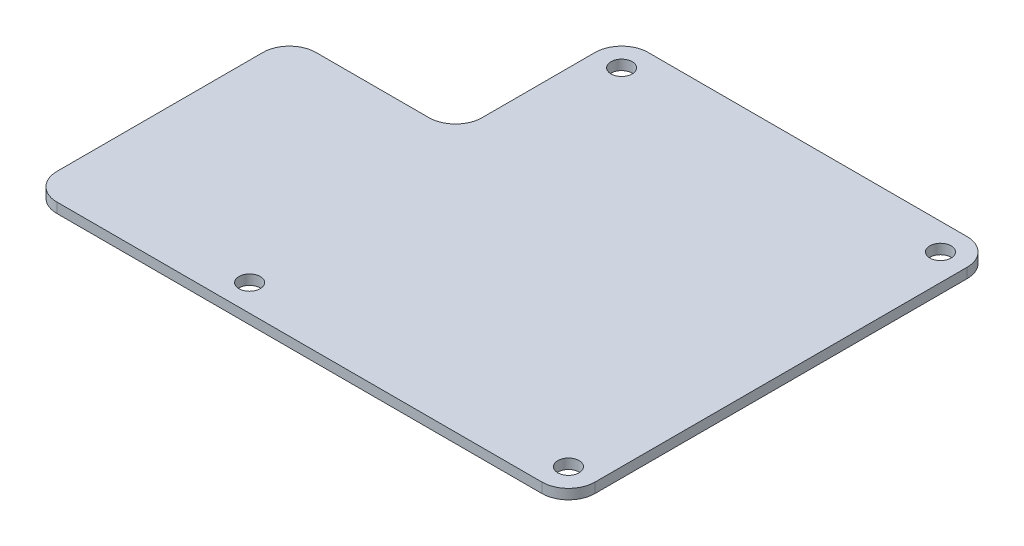
ISO-10303-21;
HEADER;
FILE_DESCRIPTION(('STEP AP214'),'2;1');
FILE_NAME('part.step','',(''),(''),'','','');
FILE_SCHEMA(('AUTOMOTIVE_DESIGN { 1 0 10303 214 1 1 1 1 }'));
ENDSEC;
DATA;
#1=APPLICATION_CONTEXT('core data for automotive mechanical design processes');
#2=APPLICATION_PROTOCOL_DEFINITION('international standard','automotive_design',2000,#1);
#3=PRODUCT_CONTEXT('',#1,'mechanical');
#4=PRODUCT('Part','Part','',(#3));
#5=PRODUCT_RELATED_PRODUCT_CATEGORY('part','',(#4));
#6=PRODUCT_DEFINITION_FORMATION('','',#4);
#7=PRODUCT_DEFINITION_CONTEXT('part definition',#1,'design');
#8=PRODUCT_DEFINITION('design','',#6,#7);
#9=PRODUCT_DEFINITION_SHAPE('','',#8);
#10=(LENGTH_UNIT() NAMED_UNIT(*) SI_UNIT(.MILLI.,.METRE.));
#11=(NAMED_UNIT(*) PLANE_ANGLE_UNIT() SI_UNIT($,.RADIAN.));
#12=(NAMED_UNIT(*) SI_UNIT($,.STERADIAN.) SOLID_ANGLE_UNIT());
#13=UNCERTAINTY_MEASURE_WITH_UNIT(LENGTH_MEASURE(1.E-05),#10,'distance_accuracy_value','');
#14=(GEOMETRIC_REPRESENTATION_CONTEXT(3) GLOBAL_UNCERTAINTY_ASSIGNED_CONTEXT((#13)) GLOBAL_UNIT_ASSIGNED_CONTEXT((#10,
#11,#12)) REPRESENTATION_CONTEXT('',''));
#15=CARTESIAN_POINT('',(0.,0.,0.));
#16=DIRECTION('',(0.,0.,1.));
#17=DIRECTION('',(1.,0.,0.));
#18=AXIS2_PLACEMENT_3D('',#15,#16,#17);
#19=CARTESIAN_POINT('',(0.,1.5,-56.));
#20=DIRECTION('',(0.,1.,0.));
#21=DIRECTION('',(0.,0.,1.));
#22=AXIS2_PLACEMENT_3D('',#19,#20,#21);
#23=PLANE('',#22);
#24=CARTESIAN_POINT('',(48.,1.5,0.));
#25=DIRECTION('',(0.,1.,0.));
#26=DIRECTION('',(0.,0.,1.));
#27=AXIS2_PLACEMENT_3D('',#24,#25,#26);
#28=CIRCLE('',#27,1.6);
#29=CARTESIAN_POINT('',(48.,1.5,1.59999999999999));
#30=VERTEX_POINT('',#29);
#31=EDGE_CURVE('E291',#30,#30,#28,.T.);
#32=ORIENTED_EDGE('',*,*,#31,.F.);
#33=EDGE_LOOP('',(#32));
#34=FACE_BOUND('',#33,.T.);
#35=CARTESIAN_POINT('',(0.,1.5,-56.));
#36=DIRECTION('',(0.,1.,0.));
#37=DIRECTION('',(0.,0.,1.));
#38=AXIS2_PLACEMENT_3D('',#35,#36,#37);
#39=CIRCLE('',#38,1.6);
#40=CARTESIAN_POINT('',(0.,1.5,-54.4));
#41=VERTEX_POINT('',#40);
#42=EDGE_CURVE('E158',#41,#41,#39,.T.);
#43=ORIENTED_EDGE('',*,*,#42,.F.);
#44=EDGE_LOOP('',(#43));
#45=FACE_BOUND('',#44,.T.);
#46=CARTESIAN_POINT('',(0.,1.5,-56.));
#47=DIRECTION('',(0.,1.,0.));
#48=DIRECTION('',(0.,0.,1.));
#49=AXIS2_PLACEMENT_3D('',#46,#47,#48);
#50=CIRCLE('',#49,4.);
#51=CARTESIAN_POINT('',(0.,1.5,-60.));
#52=VERTEX_POINT('',#51);
#53=CARTESIAN_POINT('',(-4.,1.5,-56.));
#54=VERTEX_POINT('',#53);
#55=EDGE_CURVE('E178',#52,#54,#50,.T.);
#56=ORIENTED_EDGE('',*,*,#55,.T.);
#57=DIRECTION('',(0.,0.,1.));
#58=VECTOR('',#57,1.);
#59=CARTESIAN_POINT('',(-4.,1.5,-39.));
#60=LINE('',#59,#58);
#61=CARTESIAN_POINT('',(-4.,1.5,-39.));
#62=VERTEX_POINT('',#61);
#63=EDGE_CURVE('E105',#54,#62,#60,.T.);
#64=ORIENTED_EDGE('',*,*,#63,.T.);
#65=CARTESIAN_POINT('',(-8.,1.5,-39.));
#66=DIRECTION('',(0.,-1.,0.));
#67=DIRECTION('',(0.,0.,1.));
#68=AXIS2_PLACEMENT_3D('',#65,#66,#67);
#69=CIRCLE('',#68,4.);
#70=CARTESIAN_POINT('',(-8.00000000000003,1.5,-35.));
#71=VERTEX_POINT('',#70);
#72=EDGE_CURVE('E205',#62,#71,#69,.T.);
#73=ORIENTED_EDGE('',*,*,#72,.T.);
#74=DIRECTION('',(-1.,0.,0.));
#75=VECTOR('',#74,1.);
#76=CARTESIAN_POINT('',(-8.00000000000003,1.5,-35.));
#77=LINE('',#76,#75);
#78=CARTESIAN_POINT('',(-25.,1.5,-35.));
#79=VERTEX_POINT('',#78);
#80=EDGE_CURVE('E224',#71,#79,#77,.T.);
#81=ORIENTED_EDGE('',*,*,#80,.T.);
#82=CARTESIAN_POINT('',(-25.,1.5,-31.));
#83=DIRECTION('',(0.,1.,0.));
#84=DIRECTION('',(0.,0.,-1.));
#85=AXIS2_PLACEMENT_3D('',#82,#83,#84);
#86=CIRCLE('',#85,4.);
#87=CARTESIAN_POINT('',(-29.,1.5,-31.));
#88=VERTEX_POINT('',#87);
#89=EDGE_CURVE('E221',#79,#88,#86,.T.);
#90=ORIENTED_EDGE('',*,*,#89,.T.);
#91=DIRECTION('',(0.,0.,1.));
#92=VECTOR('',#91,1.);
#93=CARTESIAN_POINT('',(-29.,1.5,0.));
#94=LINE('',#93,#92);
#95=CARTESIAN_POINT('',(-29.,1.5,0.));
#96=VERTEX_POINT('',#95);
#97=EDGE_CURVE('E223',#88,#96,#94,.T.);
#98=ORIENTED_EDGE('',*,*,#97,.T.);
#99=CARTESIAN_POINT('',(-25.,1.5,0.));
#100=DIRECTION('',(0.,1.,0.));
#101=DIRECTION('',(0.,0.,1.));
#102=AXIS2_PLACEMENT_3D('',#99,#100,#101);
#103=CIRCLE('',#102,4.);
#104=CARTESIAN_POINT('',(-25.,1.5,4.00000000000001));
#105=VERTEX_POINT('',#104);
#106=EDGE_CURVE('E226',#96,#105,#103,.T.);
#107=ORIENTED_EDGE('',*,*,#106,.T.);
#108=DIRECTION('',(1.,0.,0.));
#109=VECTOR('',#108,1.);
#110=CARTESIAN_POINT('',(-8.,1.5,4.));
#111=LINE('',#110,#109);
#112=CARTESIAN_POINT('',(48.,1.5,4.));
#113=VERTEX_POINT('',#112);
#114=EDGE_CURVE('E232',#105,#113,#111,.T.);
#115=ORIENTED_EDGE('',*,*,#114,.T.);
#116=CARTESIAN_POINT('',(48.,1.5,0.));
#117=DIRECTION('',(0.,1.,0.));
#118=DIRECTION('',(0.,0.,1.));
#119=AXIS2_PLACEMENT_3D('',#116,#117,#118);
#120=CIRCLE('',#119,4.);
#121=CARTESIAN_POINT('',(52.,1.5,0.));
#122=VERTEX_POINT('',#121);
#123=EDGE_CURVE('E136',#113,#122,#120,.T.);
#124=ORIENTED_EDGE('',*,*,#123,.T.);
#125=DIRECTION('',(0.,0.,-1.));
#126=VECTOR('',#125,1.);
#127=CARTESIAN_POINT('',(52.,1.5,-56.));
#128=LINE('',#127,#126);
#129=CARTESIAN_POINT('',(52.,1.5,-56.));
#130=VERTEX_POINT('',#129);
#131=EDGE_CURVE('E130',#122,#130,#128,.T.);
#132=ORIENTED_EDGE('',*,*,#131,.T.);
#133=CARTESIAN_POINT('',(48.,1.5,-56.));
#134=DIRECTION('',(0.,1.,0.));
#135=DIRECTION('',(0.,0.,1.));
#136=AXIS2_PLACEMENT_3D('',#133,#134,#135);
#137=CIRCLE('',#136,4.);
#138=CARTESIAN_POINT('',(48.,1.5,-60.));
#139=VERTEX_POINT('',#138);
#140=EDGE_CURVE('E134',#130,#139,#137,.T.);
#141=ORIENTED_EDGE('',*,*,#140,.T.);
#142=DIRECTION('',(-1.,0.,0.));
#143=VECTOR('',#142,1.);
#144=CARTESIAN_POINT('',(0.,1.5,-60.));
#145=LINE('',#144,#143);
#146=EDGE_CURVE('E50',#139,#52,#145,.T.);
#147=ORIENTED_EDGE('',*,*,#146,.T.);
#148=EDGE_LOOP('',(#56,#64,#73,#81,#90,#98,#107,#115,#124,#132,#141,#147));
#149=FACE_BOUND('',#148,.T.);
#150=CARTESIAN_POINT('',(48.,1.5,-56.));
#151=DIRECTION('',(0.,1.,0.));
#152=DIRECTION('',(0.,0.,1.));
#153=AXIS2_PLACEMENT_3D('',#150,#151,#152);
#154=CIRCLE('',#153,1.6);
#155=CARTESIAN_POINT('',(48.,1.5,-54.4));
#156=VERTEX_POINT('',#155);
#157=EDGE_CURVE('E297',#156,#156,#154,.T.);
#158=ORIENTED_EDGE('',*,*,#157,.F.);
#159=EDGE_LOOP('',(#158));
#160=FACE_BOUND('',#159,.T.);
#161=CARTESIAN_POINT('',(0.,1.5,0.));
#162=DIRECTION('',(0.,1.,0.));
#163=DIRECTION('',(0.,0.,1.));
#164=AXIS2_PLACEMENT_3D('',#161,#162,#163);
#165=CIRCLE('',#164,1.6);
#166=CARTESIAN_POINT('',(0.,1.5,1.6));
#167=VERTEX_POINT('',#166);
#168=EDGE_CURVE('E282',#167,#167,#165,.T.);
#169=ORIENTED_EDGE('',*,*,#168,.F.);
#170=EDGE_LOOP('',(#169));
#171=FACE_BOUND('',#170,.T.);
#172=ADVANCED_FACE('F33',(#34,#45,#149,#160,#171),#23,.T.);
#173=CARTESIAN_POINT('',(0.,0.,-56.));
#174=DIRECTION('',(0.,1.,0.));
#175=DIRECTION('',(0.,0.,1.));
#176=AXIS2_PLACEMENT_3D('',#173,#174,#175);
#177=PLANE('',#176);
#178=CARTESIAN_POINT('',(0.,0.,-56.));
#179=DIRECTION('',(0.,1.,0.));
#180=DIRECTION('',(0.,0.,1.));
#181=AXIS2_PLACEMENT_3D('',#178,#179,#180);
#182=CIRCLE('',#181,4.);
#183=CARTESIAN_POINT('',(0.,0.,-60.));
#184=VERTEX_POINT('',#183);
#185=CARTESIAN_POINT('',(-4.,0.,-56.));
#186=VERTEX_POINT('',#185);
#187=EDGE_CURVE('E154',#184,#186,#182,.T.);
#188=ORIENTED_EDGE('',*,*,#187,.F.);
#189=DIRECTION('',(-1.,0.,0.));
#190=VECTOR('',#189,1.);
#191=CARTESIAN_POINT('',(0.,0.,-60.));
#192=LINE('',#191,#190);
#193=CARTESIAN_POINT('',(48.,0.,-60.));
#194=VERTEX_POINT('',#193);
#195=EDGE_CURVE('E97',#194,#184,#192,.T.);
#196=ORIENTED_EDGE('',*,*,#195,.F.);
#197=CARTESIAN_POINT('',(48.,0.,-56.));
#198=DIRECTION('',(0.,1.,0.));
#199=DIRECTION('',(0.,0.,1.));
#200=AXIS2_PLACEMENT_3D('',#197,#198,#199);
#201=CIRCLE('',#200,4.);
#202=CARTESIAN_POINT('',(52.,0.,-56.));
#203=VERTEX_POINT('',#202);
#204=EDGE_CURVE('E91',#203,#194,#201,.T.);
#205=ORIENTED_EDGE('',*,*,#204,.F.);
#206=DIRECTION('',(0.,0.,-1.));
#207=VECTOR('',#206,1.);
#208=CARTESIAN_POINT('',(52.,0.,-56.));
#209=LINE('',#208,#207);
#210=CARTESIAN_POINT('',(52.,0.,0.));
#211=VERTEX_POINT('',#210);
#212=EDGE_CURVE('E144',#211,#203,#209,.T.);
#213=ORIENTED_EDGE('',*,*,#212,.F.);
#214=CARTESIAN_POINT('',(48.,0.,0.));
#215=DIRECTION('',(0.,1.,0.));
#216=DIRECTION('',(0.,0.,1.));
#217=AXIS2_PLACEMENT_3D('',#214,#215,#216);
#218=CIRCLE('',#217,4.);
#219=CARTESIAN_POINT('',(48.,0.,4.));
#220=VERTEX_POINT('',#219);
#221=EDGE_CURVE('E173',#220,#211,#218,.T.);
#222=ORIENTED_EDGE('',*,*,#221,.F.);
#223=DIRECTION('',(1.,0.,0.));
#224=VECTOR('',#223,1.);
#225=CARTESIAN_POINT('',(48.,0.,4.));
#226=LINE('',#225,#224);
#227=CARTESIAN_POINT('',(-25.,0.,4.00000000000001));
#228=VERTEX_POINT('',#227);
#229=EDGE_CURVE('E171',#228,#220,#226,.T.);
#230=ORIENTED_EDGE('',*,*,#229,.F.);
#231=CARTESIAN_POINT('',(-25.,0.,0.));
#232=DIRECTION('',(0.,1.,0.));
#233=DIRECTION('',(0.,0.,1.));
#234=AXIS2_PLACEMENT_3D('',#231,#232,#233);
#235=CIRCLE('',#234,4.);
#236=CARTESIAN_POINT('',(-29.,0.,0.));
#237=VERTEX_POINT('',#236);
#238=EDGE_CURVE('E168',#237,#228,#235,.T.);
#239=ORIENTED_EDGE('',*,*,#238,.F.);
#240=DIRECTION('',(0.,0.,1.));
#241=VECTOR('',#240,1.);
#242=CARTESIAN_POINT('',(-29.,0.,0.));
#243=LINE('',#242,#241);
#244=CARTESIAN_POINT('',(-29.,0.,-31.));
#245=VERTEX_POINT('',#244);
#246=EDGE_CURVE('E166',#245,#237,#243,.T.);
#247=ORIENTED_EDGE('',*,*,#246,.F.);
#248=CARTESIAN_POINT('',(-25.,0.,-31.));
#249=DIRECTION('',(0.,1.,0.));
#250=DIRECTION('',(0.,0.,-1.));
#251=AXIS2_PLACEMENT_3D('',#248,#249,#250);
#252=CIRCLE('',#251,4.);
#253=CARTESIAN_POINT('',(-25.,0.,-35.));
#254=VERTEX_POINT('',#253);
#255=EDGE_CURVE('E164',#254,#245,#252,.T.);
#256=ORIENTED_EDGE('',*,*,#255,.F.);
#257=DIRECTION('',(-1.,0.,0.));
#258=VECTOR('',#257,1.);
#259=CARTESIAN_POINT('',(-8.00000000000003,0.,-35.));
#260=LINE('',#259,#258);
#261=CARTESIAN_POINT('',(-8.00000000000003,0.,-35.));
#262=VERTEX_POINT('',#261);
#263=EDGE_CURVE('E162',#262,#254,#260,.T.);
#264=ORIENTED_EDGE('',*,*,#263,.F.);
#265=CARTESIAN_POINT('',(-8.,0.,-39.));
#266=DIRECTION('',(0.,-1.,0.));
#267=DIRECTION('',(0.,0.,1.));
#268=AXIS2_PLACEMENT_3D('',#265,#266,#267);
#269=CIRCLE('',#268,4.);
#270=CARTESIAN_POINT('',(-4.,0.,-39.));
#271=VERTEX_POINT('',#270);
#272=EDGE_CURVE('E160',#271,#262,#269,.T.);
#273=ORIENTED_EDGE('',*,*,#272,.F.);
#274=DIRECTION('',(0.,0.,1.));
#275=VECTOR('',#274,1.);
#276=CARTESIAN_POINT('',(-4.,0.,-39.));
#277=LINE('',#276,#275);
#278=EDGE_CURVE('E157',#186,#271,#277,.T.);
#279=ORIENTED_EDGE('',*,*,#278,.F.);
#280=EDGE_LOOP('',(#188,#196,#205,#213,#222,#230,#239,#247,#256,#264,#273,#279));
#281=FACE_BOUND('',#280,.T.);
#282=CARTESIAN_POINT('',(0.,0.,-56.));
#283=DIRECTION('',(0.,1.,0.));
#284=DIRECTION('',(0.,0.,1.));
#285=AXIS2_PLACEMENT_3D('',#282,#283,#284);
#286=CIRCLE('',#285,1.6);
#287=CARTESIAN_POINT('',(0.,0.,-54.4));
#288=VERTEX_POINT('',#287);
#289=EDGE_CURVE('E300',#288,#288,#286,.T.);
#290=ORIENTED_EDGE('',*,*,#289,.T.);
#291=EDGE_LOOP('',(#290));
#292=FACE_BOUND('',#291,.T.);
#293=CARTESIAN_POINT('',(48.,0.,-56.));
#294=DIRECTION('',(0.,1.,0.));
#295=DIRECTION('',(0.,0.,1.));
#296=AXIS2_PLACEMENT_3D('',#293,#294,#295);
#297=CIRCLE('',#296,1.6);
#298=CARTESIAN_POINT('',(48.,0.,-54.4));
#299=VERTEX_POINT('',#298);
#300=EDGE_CURVE('E294',#299,#299,#297,.T.);
#301=ORIENTED_EDGE('',*,*,#300,.T.);
#302=EDGE_LOOP('',(#301));
#303=FACE_BOUND('',#302,.T.);
#304=CARTESIAN_POINT('',(48.,0.,0.));
#305=DIRECTION('',(0.,1.,0.));
#306=DIRECTION('',(0.,0.,1.));
#307=AXIS2_PLACEMENT_3D('',#304,#305,#306);
#308=CIRCLE('',#307,1.6);
#309=CARTESIAN_POINT('',(48.,0.,1.59999999999999));
#310=VERTEX_POINT('',#309);
#311=EDGE_CURVE('E288',#310,#310,#308,.T.);
#312=ORIENTED_EDGE('',*,*,#311,.T.);
#313=EDGE_LOOP('',(#312));
#314=FACE_BOUND('',#313,.T.);
#315=CARTESIAN_POINT('',(0.,0.,0.));
#316=DIRECTION('',(0.,1.,0.));
#317=DIRECTION('',(0.,0.,1.));
#318=AXIS2_PLACEMENT_3D('',#315,#316,#317);
#319=CIRCLE('',#318,1.6);
#320=CARTESIAN_POINT('',(0.,0.,1.6));
#321=VERTEX_POINT('',#320);
#322=EDGE_CURVE('E285',#321,#321,#319,.T.);
#323=ORIENTED_EDGE('',*,*,#322,.T.);
#324=EDGE_LOOP('',(#323));
#325=FACE_BOUND('',#324,.T.);
#326=ADVANCED_FACE('F209',(#281,#292,#303,#314,#325),#177,.F.);
#327=CARTESIAN_POINT('',(0.,1.5,-56.));
#328=DIRECTION('',(0.,-1.,0.));
#329=DIRECTION('',(0.,0.,-1.));
#330=AXIS2_PLACEMENT_3D('',#327,#328,#329);
#331=CYLINDRICAL_SURFACE('',#330,4.);
#332=ORIENTED_EDGE('',*,*,#187,.T.);
#333=DIRECTION('',(0.,-1.,0.));
#334=VECTOR('',#333,1.);
#335=CARTESIAN_POINT('',(-4.,1.5,-56.));
#336=LINE('',#335,#334);
#337=EDGE_CURVE('E11',#54,#186,#336,.T.);
#338=ORIENTED_EDGE('',*,*,#337,.F.);
#339=ORIENTED_EDGE('',*,*,#55,.F.);
#340=DIRECTION('',(0.,-1.,0.));
#341=VECTOR('',#340,1.);
#342=CARTESIAN_POINT('',(0.,1.5,-60.));
#343=LINE('',#342,#341);
#344=EDGE_CURVE('E150',#52,#184,#343,.T.);
#345=ORIENTED_EDGE('',*,*,#344,.T.);
#346=EDGE_LOOP('',(#332,#338,#339,#345));
#347=FACE_BOUND('',#346,.T.);
#348=ADVANCED_FACE('F35',(#347),#331,.T.);
#349=CARTESIAN_POINT('',(-4.,1.5,-39.));
#350=DIRECTION('',(1.,0.,0.));
#351=DIRECTION('',(0.,0.,-1.));
#352=AXIS2_PLACEMENT_3D('',#349,#350,#351);
#353=PLANE('',#352);
#354=ORIENTED_EDGE('',*,*,#278,.T.);
#355=DIRECTION('',(0.,-1.,0.));
#356=VECTOR('',#355,1.);
#357=CARTESIAN_POINT('',(-4.,1.5,-39.));
#358=LINE('',#357,#356);
#359=EDGE_CURVE('E42',#62,#271,#358,.T.);
#360=ORIENTED_EDGE('',*,*,#359,.F.);
#361=ORIENTED_EDGE('',*,*,#63,.F.);
#362=ORIENTED_EDGE('',*,*,#337,.T.);
#363=EDGE_LOOP('',(#354,#360,#361,#362));
#364=FACE_BOUND('',#363,.T.);
#365=ADVANCED_FACE('F411',(#364),#353,.F.);
#366=CARTESIAN_POINT('',(-8.,1.5,-39.));
#367=DIRECTION('',(0.,-1.,0.));
#368=DIRECTION('',(0.,0.,-1.));
#369=AXIS2_PLACEMENT_3D('',#366,#367,#368);
#370=CYLINDRICAL_SURFACE('',#369,4.);
#371=ORIENTED_EDGE('',*,*,#272,.T.);
#372=DIRECTION('',(0.,-1.,0.));
#373=VECTOR('',#372,1.);
#374=CARTESIAN_POINT('',(-8.00000000000003,1.5,-35.));
#375=LINE('',#374,#373);
#376=EDGE_CURVE('E197',#71,#262,#375,.T.);
#377=ORIENTED_EDGE('',*,*,#376,.F.);
#378=ORIENTED_EDGE('',*,*,#72,.F.);
#379=ORIENTED_EDGE('',*,*,#359,.T.);
#380=EDGE_LOOP('',(#371,#377,#378,#379));
#381=FACE_BOUND('',#380,.T.);
#382=ADVANCED_FACE('F203',(#381),#370,.F.);
#383=CARTESIAN_POINT('',(-8.00000000000003,1.5,-35.));
#384=DIRECTION('',(0.,0.,1.));
#385=DIRECTION('',(1.,0.,0.));
#386=AXIS2_PLACEMENT_3D('',#383,#384,#385);
#387=PLANE('',#386);
#388=ORIENTED_EDGE('',*,*,#263,.T.);
#389=DIRECTION('',(0.,-1.,0.));
#390=VECTOR('',#389,1.);
#391=CARTESIAN_POINT('',(-25.,1.5,-35.));
#392=LINE('',#391,#390);
#393=EDGE_CURVE('E194',#79,#254,#392,.T.);
#394=ORIENTED_EDGE('',*,*,#393,.F.);
#395=ORIENTED_EDGE('',*,*,#80,.F.);
#396=ORIENTED_EDGE('',*,*,#376,.T.);
#397=EDGE_LOOP('',(#388,#394,#395,#396));
#398=FACE_BOUND('',#397,.T.);
#399=ADVANCED_FACE('F215',(#398),#387,.F.);
#400=CARTESIAN_POINT('',(-25.,1.5,-31.));
#401=DIRECTION('',(0.,-1.,0.));
#402=DIRECTION('',(0.,0.,-1.));
#403=AXIS2_PLACEMENT_3D('',#400,#401,#402);
#404=CYLINDRICAL_SURFACE('',#403,4.);
#405=ORIENTED_EDGE('',*,*,#255,.T.);
#406=DIRECTION('',(0.,-1.,0.));
#407=VECTOR('',#406,1.);
#408=CARTESIAN_POINT('',(-29.,1.5,-31.));
#409=LINE('',#408,#407);
#410=EDGE_CURVE('E191',#88,#245,#409,.T.);
#411=ORIENTED_EDGE('',*,*,#410,.F.);
#412=ORIENTED_EDGE('',*,*,#89,.F.);
#413=ORIENTED_EDGE('',*,*,#393,.T.);
#414=EDGE_LOOP('',(#405,#411,#412,#413));
#415=FACE_BOUND('',#414,.T.);
#416=ADVANCED_FACE('F219',(#415),#404,.T.);
#417=CARTESIAN_POINT('',(-29.,1.5,0.));
#418=DIRECTION('',(1.,0.,0.));
#419=DIRECTION('',(0.,0.,-1.));
#420=AXIS2_PLACEMENT_3D('',#417,#418,#419);
#421=PLANE('',#420);
#422=ORIENTED_EDGE('',*,*,#246,.T.);
#423=DIRECTION('',(0.,-1.,0.));
#424=VECTOR('',#423,1.);
#425=CARTESIAN_POINT('',(-29.,1.5,0.));
#426=LINE('',#425,#424);
#427=EDGE_CURVE('E188',#96,#237,#426,.T.);
#428=ORIENTED_EDGE('',*,*,#427,.F.);
#429=ORIENTED_EDGE('',*,*,#97,.F.);
#430=ORIENTED_EDGE('',*,*,#410,.T.);
#431=EDGE_LOOP('',(#422,#428,#429,#430));
#432=FACE_BOUND('',#431,.T.);
#433=ADVANCED_FACE('F376',(#432),#421,.F.);
#434=CARTESIAN_POINT('',(-25.,1.5,0.));
#435=DIRECTION('',(0.,-1.,0.));
#436=DIRECTION('',(0.,0.,-1.));
#437=AXIS2_PLACEMENT_3D('',#434,#435,#436);
#438=CYLINDRICAL_SURFACE('',#437,4.);
#439=ORIENTED_EDGE('',*,*,#238,.T.);
#440=DIRECTION('',(0.,-1.,0.));
#441=VECTOR('',#440,1.);
#442=CARTESIAN_POINT('',(-25.,1.5,4.00000000000001));
#443=LINE('',#442,#441);
#444=EDGE_CURVE('E185',#105,#228,#443,.T.);
#445=ORIENTED_EDGE('',*,*,#444,.F.);
#446=ORIENTED_EDGE('',*,*,#106,.F.);
#447=ORIENTED_EDGE('',*,*,#427,.T.);
#448=EDGE_LOOP('',(#439,#445,#446,#447));
#449=FACE_BOUND('',#448,.T.);
#450=ADVANCED_FACE('F366',(#449),#438,.T.);
#451=CARTESIAN_POINT('',(48.,1.5,4.));
#452=DIRECTION('',(0.,0.,-1.));
#453=DIRECTION('',(-1.,0.,0.));
#454=AXIS2_PLACEMENT_3D('',#451,#452,#453);
#455=PLANE('',#454);
#456=ORIENTED_EDGE('',*,*,#229,.T.);
#457=DIRECTION('',(0.,-1.,0.));
#458=VECTOR('',#457,1.);
#459=CARTESIAN_POINT('',(48.,1.5,4.));
#460=LINE('',#459,#458);
#461=EDGE_CURVE('E182',#113,#220,#460,.T.);
#462=ORIENTED_EDGE('',*,*,#461,.F.);
#463=ORIENTED_EDGE('',*,*,#114,.F.);
#464=ORIENTED_EDGE('',*,*,#444,.T.);
#465=EDGE_LOOP('',(#456,#462,#463,#464));
#466=FACE_BOUND('',#465,.T.);
#467=ADVANCED_FACE('F238',(#466),#455,.F.);
#468=CARTESIAN_POINT('',(48.,1.5,0.));
#469=DIRECTION('',(0.,-1.,0.));
#470=DIRECTION('',(0.,0.,-1.));
#471=AXIS2_PLACEMENT_3D('',#468,#469,#470);
#472=CYLINDRICAL_SURFACE('',#471,4.);
#473=ORIENTED_EDGE('',*,*,#221,.T.);
#474=DIRECTION('',(0.,-1.,0.));
#475=VECTOR('',#474,1.);
#476=CARTESIAN_POINT('',(52.,1.5,0.));
#477=LINE('',#476,#475);
#478=EDGE_CURVE('E145',#122,#211,#477,.T.);
#479=ORIENTED_EDGE('',*,*,#478,.F.);
#480=ORIENTED_EDGE('',*,*,#123,.F.);
#481=ORIENTED_EDGE('',*,*,#461,.T.);
#482=EDGE_LOOP('',(#473,#479,#480,#481));
#483=FACE_BOUND('',#482,.T.);
#484=ADVANCED_FACE('F241',(#483),#472,.T.);
#485=CARTESIAN_POINT('',(52.,1.5,-56.));
#486=DIRECTION('',(-1.,0.,0.));
#487=DIRECTION('',(0.,0.,1.));
#488=AXIS2_PLACEMENT_3D('',#485,#486,#487);
#489=PLANE('',#488);
#490=ORIENTED_EDGE('',*,*,#212,.T.);
#491=DIRECTION('',(0.,-1.,0.));
#492=VECTOR('',#491,1.);
#493=CARTESIAN_POINT('',(52.,1.5,-56.));
#494=LINE('',#493,#492);
#495=EDGE_CURVE('E141',#130,#203,#494,.T.);
#496=ORIENTED_EDGE('',*,*,#495,.F.);
#497=ORIENTED_EDGE('',*,*,#131,.F.);
#498=ORIENTED_EDGE('',*,*,#478,.T.);
#499=EDGE_LOOP('',(#490,#496,#497,#498));
#500=FACE_BOUND('',#499,.T.);
#501=ADVANCED_FACE('F142',(#500),#489,.F.);
#502=CARTESIAN_POINT('',(48.,1.5,-56.));
#503=DIRECTION('',(0.,-1.,0.));
#504=DIRECTION('',(0.,0.,-1.));
#505=AXIS2_PLACEMENT_3D('',#502,#503,#504);
#506=CYLINDRICAL_SURFACE('',#505,4.);
#507=ORIENTED_EDGE('',*,*,#204,.T.);
#508=DIRECTION('',(0.,-1.,0.));
#509=VECTOR('',#508,1.);
#510=CARTESIAN_POINT('',(48.,1.5,-60.));
#511=LINE('',#510,#509);
#512=EDGE_CURVE('E146',#139,#194,#511,.T.);
#513=ORIENTED_EDGE('',*,*,#512,.F.);
#514=ORIENTED_EDGE('',*,*,#140,.F.);
#515=ORIENTED_EDGE('',*,*,#495,.T.);
#516=EDGE_LOOP('',(#507,#513,#514,#515));
#517=FACE_BOUND('',#516,.T.);
#518=ADVANCED_FACE('F148',(#517),#506,.T.);
#519=CARTESIAN_POINT('',(0.,1.5,-60.));
#520=DIRECTION('',(0.,0.,1.));
#521=DIRECTION('',(1.,0.,0.));
#522=AXIS2_PLACEMENT_3D('',#519,#520,#521);
#523=PLANE('',#522);
#524=ORIENTED_EDGE('',*,*,#195,.T.);
#525=ORIENTED_EDGE('',*,*,#344,.F.);
#526=ORIENTED_EDGE('',*,*,#146,.F.);
#527=ORIENTED_EDGE('',*,*,#512,.T.);
#528=EDGE_LOOP('',(#524,#525,#526,#527));
#529=FACE_BOUND('',#528,.T.);
#530=ADVANCED_FACE('F245',(#529),#523,.F.);
#531=CARTESIAN_POINT('',(0.,1.5,-56.));
#532=DIRECTION('',(0.,-1.,0.));
#533=DIRECTION('',(0.,0.,-1.));
#534=AXIS2_PLACEMENT_3D('',#531,#532,#533);
#535=CYLINDRICAL_SURFACE('',#534,1.6);
#536=ORIENTED_EDGE('',*,*,#42,.T.);
#537=EDGE_LOOP('',(#536));
#538=FACE_BOUND('',#537,.T.);
#539=ORIENTED_EDGE('',*,*,#289,.F.);
#540=EDGE_LOOP('',(#539));
#541=FACE_BOUND('',#540,.T.);
#542=ADVANCED_FACE('F247',(#538,#541),#535,.F.);
#543=CARTESIAN_POINT('',(48.,1.5,-56.));
#544=DIRECTION('',(0.,-1.,0.));
#545=DIRECTION('',(0.,0.,-1.));
#546=AXIS2_PLACEMENT_3D('',#543,#544,#545);
#547=CYLINDRICAL_SURFACE('',#546,1.6);
#548=ORIENTED_EDGE('',*,*,#157,.T.);
#549=EDGE_LOOP('',(#548));
#550=FACE_BOUND('',#549,.T.);
#551=ORIENTED_EDGE('',*,*,#300,.F.);
#552=EDGE_LOOP('',(#551));
#553=FACE_BOUND('',#552,.T.);
#554=ADVANCED_FACE('F253',(#550,#553),#547,.F.);
#555=CARTESIAN_POINT('',(48.,1.5,0.));
#556=DIRECTION('',(0.,-1.,0.));
#557=DIRECTION('',(0.,0.,-1.));
#558=AXIS2_PLACEMENT_3D('',#555,#556,#557);
#559=CYLINDRICAL_SURFACE('',#558,1.6);
#560=ORIENTED_EDGE('',*,*,#31,.T.);
#561=EDGE_LOOP('',(#560));
#562=FACE_BOUND('',#561,.T.);
#563=ORIENTED_EDGE('',*,*,#311,.F.);
#564=EDGE_LOOP('',(#563));
#565=FACE_BOUND('',#564,.T.);
#566=ADVANCED_FACE('F269',(#562,#565),#559,.F.);
#567=CARTESIAN_POINT('',(0.,1.5,0.));
#568=DIRECTION('',(0.,-1.,0.));
#569=DIRECTION('',(0.,0.,-1.));
#570=AXIS2_PLACEMENT_3D('',#567,#568,#569);
#571=CYLINDRICAL_SURFACE('',#570,1.6);
#572=ORIENTED_EDGE('',*,*,#168,.T.);
#573=EDGE_LOOP('',(#572));
#574=FACE_BOUND('',#573,.T.);
#575=ORIENTED_EDGE('',*,*,#322,.F.);
#576=EDGE_LOOP('',(#575));
#577=FACE_BOUND('',#576,.T.);
#578=ADVANCED_FACE('F273',(#574,#577),#571,.F.);
#579=CLOSED_SHELL('',(#172,#326,#348,#365,#382,#399,#416,#433,#450,#467,#484,#501,#518,#530,
#542,#554,#566,#578));
#580=MANIFOLD_SOLID_BREP('B2',#579);
#581=ADVANCED_BREP_SHAPE_REPRESENTATION('',(#18,#580),#14);
#582=SHAPE_DEFINITION_REPRESENTATION(#9,#581);
ENDSEC;
END-ISO-10303-21;
